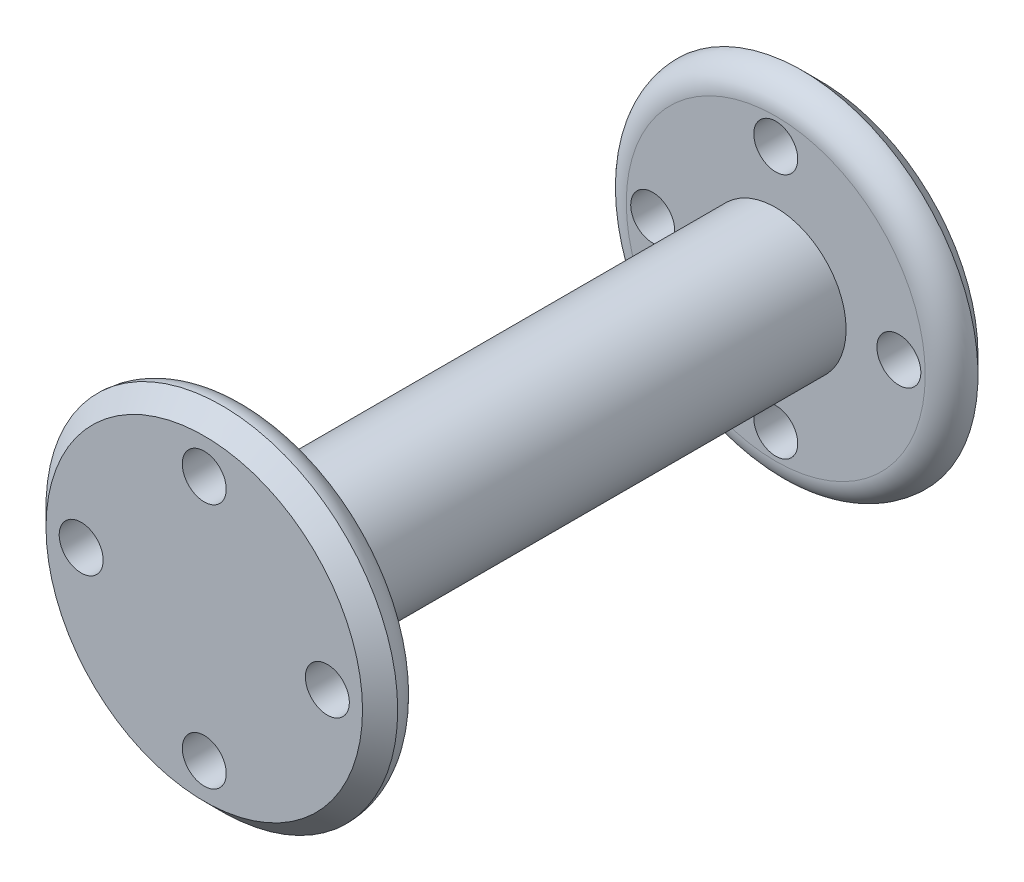
ISO-10303-21;
HEADER;
FILE_DESCRIPTION(('STEP AP214'),'2;1');
FILE_NAME('part.step','',(''),(''),'','','');
FILE_SCHEMA(('AUTOMOTIVE_DESIGN { 1 0 10303 214 1 1 1 1 }'));
ENDSEC;
DATA;
#1=APPLICATION_CONTEXT('core data for automotive mechanical design processes');
#2=APPLICATION_PROTOCOL_DEFINITION('international standard','automotive_design',2000,#1);
#3=PRODUCT_CONTEXT('',#1,'mechanical');
#4=PRODUCT('Part','Part','',(#3));
#5=PRODUCT_RELATED_PRODUCT_CATEGORY('part','',(#4));
#6=PRODUCT_DEFINITION_FORMATION('','',#4);
#7=PRODUCT_DEFINITION_CONTEXT('part definition',#1,'design');
#8=PRODUCT_DEFINITION('design','',#6,#7);
#9=PRODUCT_DEFINITION_SHAPE('','',#8);
#10=(LENGTH_UNIT() NAMED_UNIT(*) SI_UNIT(.MILLI.,.METRE.));
#11=(NAMED_UNIT(*) PLANE_ANGLE_UNIT() SI_UNIT($,.RADIAN.));
#12=(NAMED_UNIT(*) SI_UNIT($,.STERADIAN.) SOLID_ANGLE_UNIT());
#13=UNCERTAINTY_MEASURE_WITH_UNIT(LENGTH_MEASURE(1.E-05),#10,'distance_accuracy_value','');
#14=(GEOMETRIC_REPRESENTATION_CONTEXT(3) GLOBAL_UNCERTAINTY_ASSIGNED_CONTEXT((#13)) GLOBAL_UNIT_ASSIGNED_CONTEXT((#10,
#11,#12)) REPRESENTATION_CONTEXT('',''));
#15=CARTESIAN_POINT('',(0.,0.,0.));
#16=DIRECTION('',(0.,0.,1.));
#17=DIRECTION('',(1.,0.,0.));
#18=AXIS2_PLACEMENT_3D('',#15,#16,#17);
#19=CARTESIAN_POINT('',(0.,0.,30.));
#20=DIRECTION('',(0.,0.,-1.));
#21=DIRECTION('',(-1.,0.,0.));
#22=AXIS2_PLACEMENT_3D('',#19,#20,#21);
#23=CYLINDRICAL_SURFACE('',#22,8.);
#24=CARTESIAN_POINT('',(0.,0.,30.));
#25=DIRECTION('',(0.,0.,1.));
#26=DIRECTION('',(1.,0.,0.));
#27=AXIS2_PLACEMENT_3D('',#24,#25,#26);
#28=CIRCLE('',#27,8.);
#29=CARTESIAN_POINT('',(8.,0.,30.));
#30=VERTEX_POINT('',#29);
#31=EDGE_CURVE('E106',#30,#30,#28,.T.);
#32=ORIENTED_EDGE('',*,*,#31,.F.);
#33=EDGE_LOOP('',(#32));
#34=FACE_BOUND('',#33,.T.);
#35=CARTESIAN_POINT('',(0.,0.,-30.));
#36=DIRECTION('',(0.,0.,1.));
#37=DIRECTION('',(1.,0.,0.));
#38=AXIS2_PLACEMENT_3D('',#35,#36,#37);
#39=CIRCLE('',#38,8.);
#40=CARTESIAN_POINT('',(8.,0.,-30.));
#41=VERTEX_POINT('',#40);
#42=EDGE_CURVE('E63',#41,#41,#39,.T.);
#43=ORIENTED_EDGE('',*,*,#42,.T.);
#44=EDGE_LOOP('',(#43));
#45=FACE_BOUND('',#44,.T.);
#46=ADVANCED_FACE('F36',(#34,#45),#23,.T.);
#47=CARTESIAN_POINT('',(0.,0.,35.));
#48=DIRECTION('',(0.,0.,1.));
#49=DIRECTION('',(1.,0.,0.));
#50=AXIS2_PLACEMENT_3D('',#47,#48,#49);
#51=PLANE('',#50);
#52=CARTESIAN_POINT('',(14.,0.,35.));
#53=DIRECTION('',(0.,0.,1.));
#54=DIRECTION('',(0.,-1.,0.));
#55=AXIS2_PLACEMENT_3D('',#52,#53,#54);
#56=CIRCLE('',#55,2.5);
#57=CARTESIAN_POINT('',(14.,-2.50000000000006,35.));
#58=VERTEX_POINT('',#57);
#59=EDGE_CURVE('E87',#58,#58,#56,.T.);
#60=ORIENTED_EDGE('',*,*,#59,.F.);
#61=EDGE_LOOP('',(#60));
#62=FACE_BOUND('',#61,.T.);
#63=CARTESIAN_POINT('',(0.,-14.,35.));
#64=DIRECTION('',(0.,0.,1.));
#65=DIRECTION('',(-1.,0.,0.));
#66=AXIS2_PLACEMENT_3D('',#63,#64,#65);
#67=CIRCLE('',#66,2.5);
#68=CARTESIAN_POINT('',(-2.50000000000002,-14.,35.));
#69=VERTEX_POINT('',#68);
#70=EDGE_CURVE('E92',#69,#69,#67,.T.);
#71=ORIENTED_EDGE('',*,*,#70,.F.);
#72=EDGE_LOOP('',(#71));
#73=FACE_BOUND('',#72,.T.);
#74=CARTESIAN_POINT('',(-14.,1.59623472302374E-13,35.));
#75=DIRECTION('',(0.,0.,1.));
#76=DIRECTION('',(0.,1.,0.));
#77=AXIS2_PLACEMENT_3D('',#74,#75,#76);
#78=CIRCLE('',#77,2.5);
#79=CARTESIAN_POINT('',(-14.,2.50000000000016,35.));
#80=VERTEX_POINT('',#79);
#81=EDGE_CURVE('E96',#80,#80,#78,.T.);
#82=ORIENTED_EDGE('',*,*,#81,.F.);
#83=EDGE_LOOP('',(#82));
#84=FACE_BOUND('',#83,.T.);
#85=CARTESIAN_POINT('',(0.,14.,35.));
#86=DIRECTION('',(0.,0.,1.));
#87=DIRECTION('',(1.,0.,0.));
#88=AXIS2_PLACEMENT_3D('',#85,#86,#87);
#89=CIRCLE('',#88,2.5);
#90=CARTESIAN_POINT('',(2.50000000000002,14.,35.));
#91=VERTEX_POINT('',#90);
#92=EDGE_CURVE('E100',#91,#91,#89,.T.);
#93=ORIENTED_EDGE('',*,*,#92,.F.);
#94=EDGE_LOOP('',(#93));
#95=FACE_BOUND('',#94,.T.);
#96=CARTESIAN_POINT('',(0.,0.,35.));
#97=DIRECTION('',(0.,0.,1.));
#98=DIRECTION('',(1.,0.,0.));
#99=AXIS2_PLACEMENT_3D('',#96,#97,#98);
#100=CIRCLE('',#99,18.);
#101=CARTESIAN_POINT('',(18.,0.,35.));
#102=VERTEX_POINT('',#101);
#103=EDGE_CURVE('E110',#102,#102,#100,.T.);
#104=ORIENTED_EDGE('',*,*,#103,.T.);
#105=EDGE_LOOP('',(#104));
#106=FACE_BOUND('',#105,.T.);
#107=ADVANCED_FACE('F155',(#62,#73,#84,#95,#106),#51,.T.);
#108=CARTESIAN_POINT('',(0.,0.,30.));
#109=DIRECTION('',(0.,0.,1.));
#110=DIRECTION('',(1.,0.,0.));
#111=AXIS2_PLACEMENT_3D('',#108,#109,#110);
#112=PLANE('',#111);
#113=CARTESIAN_POINT('',(0.,0.,30.));
#114=DIRECTION('',(0.,0.,1.));
#115=DIRECTION('',(1.,0.,0.));
#116=AXIS2_PLACEMENT_3D('',#113,#114,#115);
#117=CIRCLE('',#116,17.);
#118=CARTESIAN_POINT('',(17.,0.,30.));
#119=VERTEX_POINT('',#118);
#120=EDGE_CURVE('E55',#119,#119,#117,.F.);
#121=ORIENTED_EDGE('',*,*,#120,.T.);
#122=EDGE_LOOP('',(#121));
#123=FACE_BOUND('',#122,.T.);
#124=CARTESIAN_POINT('',(14.,0.,30.));
#125=DIRECTION('',(0.,0.,1.));
#126=DIRECTION('',(1.,0.,0.));
#127=AXIS2_PLACEMENT_3D('',#124,#125,#126);
#128=CIRCLE('',#127,2.5);
#129=CARTESIAN_POINT('',(16.5,0.,30.));
#130=VERTEX_POINT('',#129);
#131=EDGE_CURVE('E105',#130,#130,#128,.T.);
#132=ORIENTED_EDGE('',*,*,#131,.T.);
#133=EDGE_LOOP('',(#132));
#134=FACE_BOUND('',#133,.T.);
#135=CARTESIAN_POINT('',(0.,-14.,30.));
#136=DIRECTION('',(0.,0.,1.));
#137=DIRECTION('',(1.,0.,0.));
#138=AXIS2_PLACEMENT_3D('',#135,#136,#137);
#139=CIRCLE('',#138,2.5);
#140=CARTESIAN_POINT('',(2.49999999999999,-14.,30.));
#141=VERTEX_POINT('',#140);
#142=EDGE_CURVE('E127',#141,#141,#139,.T.);
#143=ORIENTED_EDGE('',*,*,#142,.T.);
#144=EDGE_LOOP('',(#143));
#145=FACE_BOUND('',#144,.T.);
#146=CARTESIAN_POINT('',(-14.,1.59623472302374E-13,30.));
#147=DIRECTION('',(0.,0.,1.));
#148=DIRECTION('',(1.,0.,0.));
#149=AXIS2_PLACEMENT_3D('',#146,#147,#148);
#150=CIRCLE('',#149,2.5);
#151=CARTESIAN_POINT('',(-11.5,1.59623472302374E-13,30.));
#152=VERTEX_POINT('',#151);
#153=EDGE_CURVE('E91',#152,#152,#150,.T.);
#154=ORIENTED_EDGE('',*,*,#153,.T.);
#155=EDGE_LOOP('',(#154));
#156=FACE_BOUND('',#155,.T.);
#157=CARTESIAN_POINT('',(0.,14.,30.));
#158=DIRECTION('',(0.,0.,1.));
#159=DIRECTION('',(1.,0.,0.));
#160=AXIS2_PLACEMENT_3D('',#157,#158,#159);
#161=CIRCLE('',#160,2.5);
#162=CARTESIAN_POINT('',(2.50000000000002,14.,30.));
#163=VERTEX_POINT('',#162);
#164=EDGE_CURVE('E104',#163,#163,#161,.T.);
#165=ORIENTED_EDGE('',*,*,#164,.T.);
#166=EDGE_LOOP('',(#165));
#167=FACE_BOUND('',#166,.T.);
#168=ORIENTED_EDGE('',*,*,#31,.T.);
#169=EDGE_LOOP('',(#168));
#170=FACE_BOUND('',#169,.T.);
#171=ADVANCED_FACE('F137',(#123,#134,#145,#156,#167,#170),#112,.F.);
#172=CARTESIAN_POINT('',(0.,0.,35.));
#173=DIRECTION('',(0.,0.,-1.));
#174=DIRECTION('',(-1.,0.,0.));
#175=AXIS2_PLACEMENT_3D('',#172,#173,#174);
#176=CONICAL_SURFACE('',#175,18.,0.785398163397448);
#177=CARTESIAN_POINT('',(0.,0.,33.));
#178=DIRECTION('',(0.,0.,1.));
#179=DIRECTION('',(1.,0.,0.));
#180=AXIS2_PLACEMENT_3D('',#177,#178,#179);
#181=CIRCLE('',#180,20.);
#182=CARTESIAN_POINT('',(20.,0.,33.));
#183=VERTEX_POINT('',#182);
#184=EDGE_CURVE('E117',#183,#183,#181,.F.);
#185=ORIENTED_EDGE('',*,*,#184,.F.);
#186=EDGE_LOOP('',(#185));
#187=FACE_BOUND('',#186,.T.);
#188=ORIENTED_EDGE('',*,*,#103,.F.);
#189=EDGE_LOOP('',(#188));
#190=FACE_BOUND('',#189,.T.);
#191=ADVANCED_FACE('F148',(#187,#190),#176,.T.);
#192=CARTESIAN_POINT('',(0.,14.,-30.));
#193=DIRECTION('',(0.,0.,1.));
#194=DIRECTION('',(1.,0.,0.));
#195=AXIS2_PLACEMENT_3D('',#192,#193,#194);
#196=CYLINDRICAL_SURFACE('',#195,2.5);
#197=ORIENTED_EDGE('',*,*,#92,.T.);
#198=EDGE_LOOP('',(#197));
#199=FACE_BOUND('',#198,.T.);
#200=ORIENTED_EDGE('',*,*,#164,.F.);
#201=EDGE_LOOP('',(#200));
#202=FACE_BOUND('',#201,.T.);
#203=ADVANCED_FACE('F151',(#199,#202),#196,.F.);
#204=CARTESIAN_POINT('',(-14.,1.59623472302374E-13,-30.));
#205=DIRECTION('',(0.,0.,1.));
#206=DIRECTION('',(1.,0.,0.));
#207=AXIS2_PLACEMENT_3D('',#204,#205,#206);
#208=CYLINDRICAL_SURFACE('',#207,2.5);
#209=ORIENTED_EDGE('',*,*,#81,.T.);
#210=EDGE_LOOP('',(#209));
#211=FACE_BOUND('',#210,.T.);
#212=ORIENTED_EDGE('',*,*,#153,.F.);
#213=EDGE_LOOP('',(#212));
#214=FACE_BOUND('',#213,.T.);
#215=ADVANCED_FACE('F213',(#211,#214),#208,.F.);
#216=CARTESIAN_POINT('',(0.,-14.,-30.));
#217=DIRECTION('',(0.,0.,1.));
#218=DIRECTION('',(1.,0.,0.));
#219=AXIS2_PLACEMENT_3D('',#216,#217,#218);
#220=CYLINDRICAL_SURFACE('',#219,2.5);
#221=ORIENTED_EDGE('',*,*,#70,.T.);
#222=EDGE_LOOP('',(#221));
#223=FACE_BOUND('',#222,.T.);
#224=ORIENTED_EDGE('',*,*,#142,.F.);
#225=EDGE_LOOP('',(#224));
#226=FACE_BOUND('',#225,.T.);
#227=ADVANCED_FACE('F210',(#223,#226),#220,.F.);
#228=CARTESIAN_POINT('',(14.,0.,-30.));
#229=DIRECTION('',(0.,0.,1.));
#230=DIRECTION('',(1.,0.,0.));
#231=AXIS2_PLACEMENT_3D('',#228,#229,#230);
#232=CYLINDRICAL_SURFACE('',#231,2.5);
#233=ORIENTED_EDGE('',*,*,#59,.T.);
#234=EDGE_LOOP('',(#233));
#235=FACE_BOUND('',#234,.T.);
#236=ORIENTED_EDGE('',*,*,#131,.F.);
#237=EDGE_LOOP('',(#236));
#238=FACE_BOUND('',#237,.T.);
#239=ADVANCED_FACE('F144',(#235,#238),#232,.F.);
#240=CARTESIAN_POINT('',(0.,0.,33.));
#241=DIRECTION('',(0.,0.,1.));
#242=DIRECTION('',(1.,0.,0.));
#243=AXIS2_PLACEMENT_3D('',#240,#241,#242);
#244=TOROIDAL_SURFACE('',#243,17.,3.);
#245=ORIENTED_EDGE('',*,*,#120,.F.);
#246=EDGE_LOOP('',(#245));
#247=FACE_BOUND('',#246,.T.);
#248=ORIENTED_EDGE('',*,*,#184,.T.);
#249=EDGE_LOOP('',(#248));
#250=FACE_BOUND('',#249,.T.);
#251=ADVANCED_FACE('F140',(#247,#250),#244,.T.);
#252=CARTESIAN_POINT('',(0.,0.,-35.));
#253=DIRECTION('',(0.,0.,-1.));
#254=DIRECTION('',(1.,0.,0.));
#255=AXIS2_PLACEMENT_3D('',#252,#253,#254);
#256=PLANE('',#255);
#257=CARTESIAN_POINT('',(14.,0.,-35.));
#258=DIRECTION('',(0.,0.,1.));
#259=DIRECTION('',(0.,-1.,0.));
#260=AXIS2_PLACEMENT_3D('',#257,#258,#259);
#261=CIRCLE('',#260,2.5);
#262=CARTESIAN_POINT('',(14.,-2.50000000000006,-35.));
#263=VERTEX_POINT('',#262);
#264=EDGE_CURVE('E70',#263,#263,#261,.T.);
#265=ORIENTED_EDGE('',*,*,#264,.T.);
#266=EDGE_LOOP('',(#265));
#267=FACE_BOUND('',#266,.T.);
#268=CARTESIAN_POINT('',(0.,-14.,-35.));
#269=DIRECTION('',(0.,0.,1.));
#270=DIRECTION('',(-1.,0.,0.));
#271=AXIS2_PLACEMENT_3D('',#268,#269,#270);
#272=CIRCLE('',#271,2.5);
#273=CARTESIAN_POINT('',(-2.50000000000002,-14.,-35.));
#274=VERTEX_POINT('',#273);
#275=EDGE_CURVE('E339',#274,#274,#272,.T.);
#276=ORIENTED_EDGE('',*,*,#275,.T.);
#277=EDGE_LOOP('',(#276));
#278=FACE_BOUND('',#277,.T.);
#279=CARTESIAN_POINT('',(-14.,1.59623472302374E-13,-35.));
#280=DIRECTION('',(0.,0.,1.));
#281=DIRECTION('',(0.,1.,0.));
#282=AXIS2_PLACEMENT_3D('',#279,#280,#281);
#283=CIRCLE('',#282,2.5);
#284=CARTESIAN_POINT('',(-14.,2.50000000000016,-35.));
#285=VERTEX_POINT('',#284);
#286=EDGE_CURVE('E85',#285,#285,#283,.T.);
#287=ORIENTED_EDGE('',*,*,#286,.T.);
#288=EDGE_LOOP('',(#287));
#289=FACE_BOUND('',#288,.T.);
#290=CARTESIAN_POINT('',(0.,14.,-35.));
#291=DIRECTION('',(0.,0.,1.));
#292=DIRECTION('',(1.,0.,0.));
#293=AXIS2_PLACEMENT_3D('',#290,#291,#292);
#294=CIRCLE('',#293,2.5);
#295=CARTESIAN_POINT('',(2.50000000000002,14.,-35.));
#296=VERTEX_POINT('',#295);
#297=EDGE_CURVE('E64',#296,#296,#294,.T.);
#298=ORIENTED_EDGE('',*,*,#297,.T.);
#299=EDGE_LOOP('',(#298));
#300=FACE_BOUND('',#299,.T.);
#301=CARTESIAN_POINT('',(0.,0.,-35.));
#302=DIRECTION('',(0.,0.,-1.));
#303=DIRECTION('',(-1.,0.,0.));
#304=AXIS2_PLACEMENT_3D('',#301,#302,#303);
#305=CIRCLE('',#304,18.);
#306=CARTESIAN_POINT('',(-18.,0.,-35.));
#307=VERTEX_POINT('',#306);
#308=EDGE_CURVE('E44',#307,#307,#305,.T.);
#309=ORIENTED_EDGE('',*,*,#308,.T.);
#310=EDGE_LOOP('',(#309));
#311=FACE_BOUND('',#310,.T.);
#312=ADVANCED_FACE('F143',(#267,#278,#289,#300,#311),#256,.T.);
#313=CARTESIAN_POINT('',(0.,0.,-30.));
#314=DIRECTION('',(0.,0.,-1.));
#315=DIRECTION('',(1.,0.,0.));
#316=AXIS2_PLACEMENT_3D('',#313,#314,#315);
#317=PLANE('',#316);
#318=CARTESIAN_POINT('',(0.,0.,-30.));
#319=DIRECTION('',(0.,0.,-1.));
#320=DIRECTION('',(-1.,0.,0.));
#321=AXIS2_PLACEMENT_3D('',#318,#319,#320);
#322=CIRCLE('',#321,17.);
#323=CARTESIAN_POINT('',(-17.,0.,-30.));
#324=VERTEX_POINT('',#323);
#325=EDGE_CURVE('E10',#324,#324,#322,.F.);
#326=ORIENTED_EDGE('',*,*,#325,.T.);
#327=EDGE_LOOP('',(#326));
#328=FACE_BOUND('',#327,.T.);
#329=CARTESIAN_POINT('',(14.,0.,-30.));
#330=DIRECTION('',(0.,0.,-1.));
#331=DIRECTION('',(-1.,0.,0.));
#332=AXIS2_PLACEMENT_3D('',#329,#330,#331);
#333=CIRCLE('',#332,2.5);
#334=CARTESIAN_POINT('',(11.5,0.,-30.));
#335=VERTEX_POINT('',#334);
#336=EDGE_CURVE('E73',#335,#335,#333,.F.);
#337=ORIENTED_EDGE('',*,*,#336,.F.);
#338=EDGE_LOOP('',(#337));
#339=FACE_BOUND('',#338,.T.);
#340=CARTESIAN_POINT('',(0.,-14.,-30.));
#341=DIRECTION('',(0.,0.,-1.));
#342=DIRECTION('',(-1.,0.,0.));
#343=AXIS2_PLACEMENT_3D('',#340,#341,#342);
#344=CIRCLE('',#343,2.5);
#345=CARTESIAN_POINT('',(-2.50000000000002,-14.,-30.));
#346=VERTEX_POINT('',#345);
#347=EDGE_CURVE('E69',#346,#346,#344,.F.);
#348=ORIENTED_EDGE('',*,*,#347,.F.);
#349=EDGE_LOOP('',(#348));
#350=FACE_BOUND('',#349,.T.);
#351=CARTESIAN_POINT('',(-14.,1.59623472302374E-13,-30.));
#352=DIRECTION('',(0.,0.,-1.));
#353=DIRECTION('',(-1.,0.,0.));
#354=AXIS2_PLACEMENT_3D('',#351,#352,#353);
#355=CIRCLE('',#354,2.5);
#356=CARTESIAN_POINT('',(-16.5,1.59623472302374E-13,-30.));
#357=VERTEX_POINT('',#356);
#358=EDGE_CURVE('E65',#357,#357,#355,.F.);
#359=ORIENTED_EDGE('',*,*,#358,.F.);
#360=EDGE_LOOP('',(#359));
#361=FACE_BOUND('',#360,.T.);
#362=CARTESIAN_POINT('',(0.,14.,-30.));
#363=DIRECTION('',(0.,0.,-1.));
#364=DIRECTION('',(-1.,0.,0.));
#365=AXIS2_PLACEMENT_3D('',#362,#363,#364);
#366=CIRCLE('',#365,2.5);
#367=CARTESIAN_POINT('',(-2.49999999999999,14.,-30.));
#368=VERTEX_POINT('',#367);
#369=EDGE_CURVE('E59',#368,#368,#366,.F.);
#370=ORIENTED_EDGE('',*,*,#369,.F.);
#371=EDGE_LOOP('',(#370));
#372=FACE_BOUND('',#371,.T.);
#373=ORIENTED_EDGE('',*,*,#42,.F.);
#374=EDGE_LOOP('',(#373));
#375=FACE_BOUND('',#374,.T.);
#376=ADVANCED_FACE('F173',(#328,#339,#350,#361,#372,#375),#317,.F.);
#377=CARTESIAN_POINT('',(0.,0.,-33.));
#378=DIRECTION('',(0.,0.,1.));
#379=DIRECTION('',(1.,0.,0.));
#380=AXIS2_PLACEMENT_3D('',#377,#378,#379);
#381=CONICAL_SURFACE('',#380,20.,0.785398163397448);
#382=ORIENTED_EDGE('',*,*,#308,.F.);
#383=EDGE_LOOP('',(#382));
#384=FACE_BOUND('',#383,.T.);
#385=CARTESIAN_POINT('',(0.,0.,-33.));
#386=DIRECTION('',(0.,0.,-1.));
#387=DIRECTION('',(-1.,0.,0.));
#388=AXIS2_PLACEMENT_3D('',#385,#386,#387);
#389=CIRCLE('',#388,20.);
#390=CARTESIAN_POINT('',(-20.,0.,-33.));
#391=VERTEX_POINT('',#390);
#392=EDGE_CURVE('E49',#391,#391,#389,.F.);
#393=ORIENTED_EDGE('',*,*,#392,.F.);
#394=EDGE_LOOP('',(#393));
#395=FACE_BOUND('',#394,.T.);
#396=ADVANCED_FACE('F170',(#384,#395),#381,.T.);
#397=CARTESIAN_POINT('',(0.,14.,35.));
#398=DIRECTION('',(0.,0.,-1.));
#399=DIRECTION('',(-1.,0.,0.));
#400=AXIS2_PLACEMENT_3D('',#397,#398,#399);
#401=CYLINDRICAL_SURFACE('',#400,2.5);
#402=ORIENTED_EDGE('',*,*,#297,.F.);
#403=EDGE_LOOP('',(#402));
#404=FACE_BOUND('',#403,.T.);
#405=ORIENTED_EDGE('',*,*,#369,.T.);
#406=EDGE_LOOP('',(#405));
#407=FACE_BOUND('',#406,.T.);
#408=ADVANCED_FACE('F172',(#404,#407),#401,.F.);
#409=CARTESIAN_POINT('',(-14.,1.59623472302374E-13,35.));
#410=DIRECTION('',(0.,0.,-1.));
#411=DIRECTION('',(-1.,0.,0.));
#412=AXIS2_PLACEMENT_3D('',#409,#410,#411);
#413=CYLINDRICAL_SURFACE('',#412,2.5);
#414=ORIENTED_EDGE('',*,*,#286,.F.);
#415=EDGE_LOOP('',(#414));
#416=FACE_BOUND('',#415,.T.);
#417=ORIENTED_EDGE('',*,*,#358,.T.);
#418=EDGE_LOOP('',(#417));
#419=FACE_BOUND('',#418,.T.);
#420=ADVANCED_FACE('F179',(#416,#419),#413,.F.);
#421=CARTESIAN_POINT('',(0.,-14.,35.));
#422=DIRECTION('',(0.,0.,-1.));
#423=DIRECTION('',(-1.,0.,0.));
#424=AXIS2_PLACEMENT_3D('',#421,#422,#423);
#425=CYLINDRICAL_SURFACE('',#424,2.5);
#426=ORIENTED_EDGE('',*,*,#275,.F.);
#427=EDGE_LOOP('',(#426));
#428=FACE_BOUND('',#427,.T.);
#429=ORIENTED_EDGE('',*,*,#347,.T.);
#430=EDGE_LOOP('',(#429));
#431=FACE_BOUND('',#430,.T.);
#432=ADVANCED_FACE('F192',(#428,#431),#425,.F.);
#433=CARTESIAN_POINT('',(14.,0.,35.));
#434=DIRECTION('',(0.,0.,-1.));
#435=DIRECTION('',(-1.,0.,0.));
#436=AXIS2_PLACEMENT_3D('',#433,#434,#435);
#437=CYLINDRICAL_SURFACE('',#436,2.5);
#438=ORIENTED_EDGE('',*,*,#264,.F.);
#439=EDGE_LOOP('',(#438));
#440=FACE_BOUND('',#439,.T.);
#441=ORIENTED_EDGE('',*,*,#336,.T.);
#442=EDGE_LOOP('',(#441));
#443=FACE_BOUND('',#442,.T.);
#444=ADVANCED_FACE('F188',(#440,#443),#437,.F.);
#445=CARTESIAN_POINT('',(0.,0.,-33.));
#446=DIRECTION('',(0.,0.,-1.));
#447=DIRECTION('',(-1.,0.,0.));
#448=AXIS2_PLACEMENT_3D('',#445,#446,#447);
#449=TOROIDAL_SURFACE('',#448,17.,3.);
#450=ORIENTED_EDGE('',*,*,#392,.T.);
#451=EDGE_LOOP('',(#450));
#452=FACE_BOUND('',#451,.T.);
#453=ORIENTED_EDGE('',*,*,#325,.F.);
#454=EDGE_LOOP('',(#453));
#455=FACE_BOUND('',#454,.T.);
#456=ADVANCED_FACE('F38',(#452,#455),#449,.T.);
#457=CLOSED_SHELL('',(#46,#107,#171,#191,#203,#215,#227,#239,#251,#312,#376,#396,#408,#420,#432,
#444,#456));
#458=MANIFOLD_SOLID_BREP('B2',#457);
#459=ADVANCED_BREP_SHAPE_REPRESENTATION('',(#18,#458),#14);
#460=SHAPE_DEFINITION_REPRESENTATION(#9,#459);
ENDSEC;
END-ISO-10303-21;
